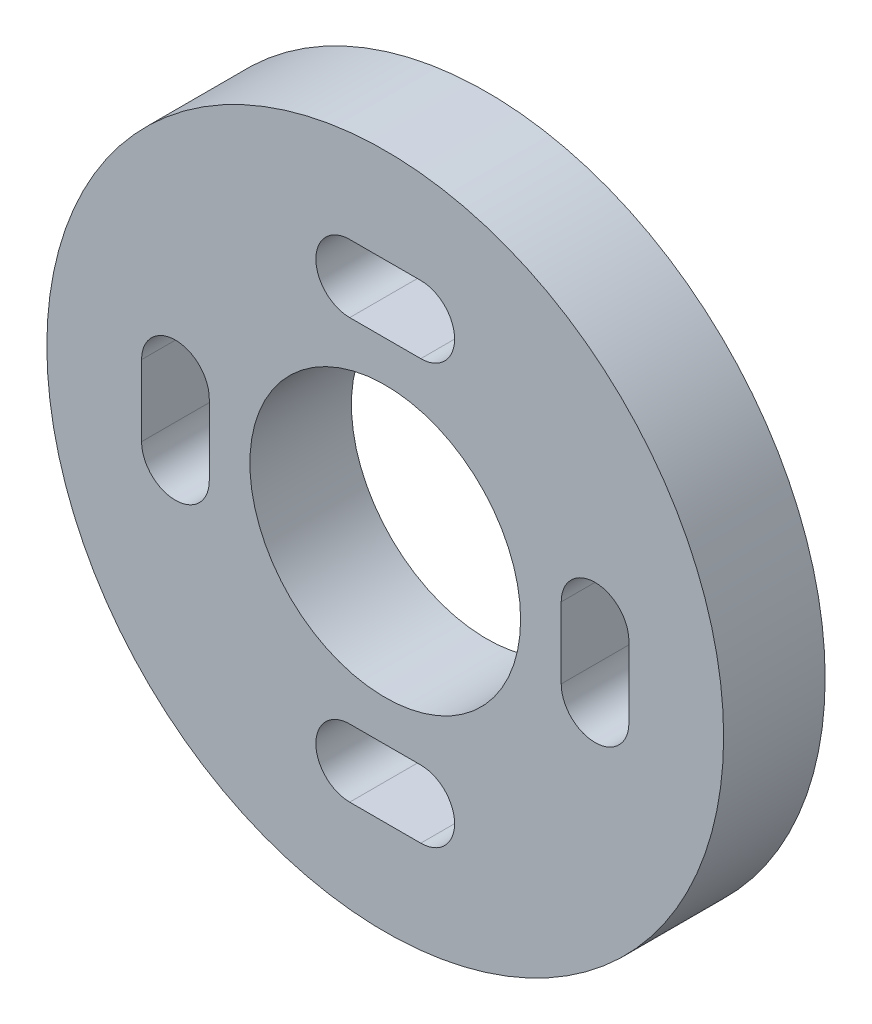
ISO-10303-21;
HEADER;
FILE_DESCRIPTION(('STEP AP214'),'2;1');
FILE_NAME('part.step','',(''),(''),'','','');
FILE_SCHEMA(('AUTOMOTIVE_DESIGN { 1 0 10303 214 1 1 1 1 }'));
ENDSEC;
DATA;
#1=APPLICATION_CONTEXT('core data for automotive mechanical design processes');
#2=APPLICATION_PROTOCOL_DEFINITION('international standard','automotive_design',2000,#1);
#3=PRODUCT_CONTEXT('',#1,'mechanical');
#4=PRODUCT('Part','Part','',(#3));
#5=PRODUCT_RELATED_PRODUCT_CATEGORY('part','',(#4));
#6=PRODUCT_DEFINITION_FORMATION('','',#4);
#7=PRODUCT_DEFINITION_CONTEXT('part definition',#1,'design');
#8=PRODUCT_DEFINITION('design','',#6,#7);
#9=PRODUCT_DEFINITION_SHAPE('','',#8);
#10=(LENGTH_UNIT() NAMED_UNIT(*) SI_UNIT(.MILLI.,.METRE.));
#11=(NAMED_UNIT(*) PLANE_ANGLE_UNIT() SI_UNIT($,.RADIAN.));
#12=(NAMED_UNIT(*) SI_UNIT($,.STERADIAN.) SOLID_ANGLE_UNIT());
#13=UNCERTAINTY_MEASURE_WITH_UNIT(LENGTH_MEASURE(1.E-05),#10,'distance_accuracy_value','');
#14=(GEOMETRIC_REPRESENTATION_CONTEXT(3) GLOBAL_UNCERTAINTY_ASSIGNED_CONTEXT((#13)) GLOBAL_UNIT_ASSIGNED_CONTEXT((#10,
#11,#12)) REPRESENTATION_CONTEXT('',''));
#15=CARTESIAN_POINT('',(0.,0.,0.));
#16=DIRECTION('',(0.,0.,1.));
#17=DIRECTION('',(1.,0.,0.));
#18=AXIS2_PLACEMENT_3D('',#15,#16,#17);
#19=CARTESIAN_POINT('',(0.,0.,3.));
#20=DIRECTION('',(0.,0.,-1.));
#21=DIRECTION('',(-1.,0.,0.));
#22=AXIS2_PLACEMENT_3D('',#19,#20,#21);
#23=CYLINDRICAL_SURFACE('',#22,10.);
#24=CARTESIAN_POINT('',(0.,0.,3.));
#25=DIRECTION('',(0.,0.,1.));
#26=DIRECTION('',(1.,0.,0.));
#27=AXIS2_PLACEMENT_3D('',#24,#25,#26);
#28=CIRCLE('',#27,10.);
#29=CARTESIAN_POINT('',(10.,0.,3.));
#30=VERTEX_POINT('',#29);
#31=EDGE_CURVE('E11',#30,#30,#28,.T.);
#32=ORIENTED_EDGE('',*,*,#31,.F.);
#33=EDGE_LOOP('',(#32));
#34=FACE_BOUND('',#33,.T.);
#35=CARTESIAN_POINT('',(0.,0.,0.));
#36=DIRECTION('',(0.,0.,1.));
#37=DIRECTION('',(1.,0.,0.));
#38=AXIS2_PLACEMENT_3D('',#35,#36,#37);
#39=CIRCLE('',#38,10.);
#40=CARTESIAN_POINT('',(10.,0.,0.));
#41=VERTEX_POINT('',#40);
#42=EDGE_CURVE('E39',#41,#41,#39,.T.);
#43=ORIENTED_EDGE('',*,*,#42,.T.);
#44=EDGE_LOOP('',(#43));
#45=FACE_BOUND('',#44,.T.);
#46=ADVANCED_FACE('F36',(#34,#45),#23,.T.);
#47=CARTESIAN_POINT('',(0.,0.,3.));
#48=DIRECTION('',(0.,0.,1.));
#49=DIRECTION('',(1.,0.,0.));
#50=AXIS2_PLACEMENT_3D('',#47,#48,#49);
#51=PLANE('',#50);
#52=DIRECTION('',(-1.,0.,0.));
#53=VECTOR('',#52,1.);
#54=CARTESIAN_POINT('',(0.,5.2,3.));
#55=LINE('',#54,#53);
#56=CARTESIAN_POINT('',(1.05,5.2,3.));
#57=VERTEX_POINT('',#56);
#58=CARTESIAN_POINT('',(-1.05,5.2,3.));
#59=VERTEX_POINT('',#58);
#60=EDGE_CURVE('E289',#57,#59,#55,.T.);
#61=ORIENTED_EDGE('',*,*,#60,.T.);
#62=CARTESIAN_POINT('',(-1.05,6.2,3.));
#63=DIRECTION('',(0.,0.,1.));
#64=DIRECTION('',(1.,0.,0.));
#65=AXIS2_PLACEMENT_3D('',#62,#63,#64);
#66=CIRCLE('',#65,1.);
#67=CARTESIAN_POINT('',(-1.05,7.2,3.));
#68=VERTEX_POINT('',#67);
#69=EDGE_CURVE('E292',#59,#68,#66,.F.);
#70=ORIENTED_EDGE('',*,*,#69,.T.);
#71=DIRECTION('',(1.,0.,0.));
#72=VECTOR('',#71,1.);
#73=CARTESIAN_POINT('',(0.,7.2,3.));
#74=LINE('',#73,#72);
#75=CARTESIAN_POINT('',(1.05,7.2,3.));
#76=VERTEX_POINT('',#75);
#77=EDGE_CURVE('E283',#68,#76,#74,.T.);
#78=ORIENTED_EDGE('',*,*,#77,.T.);
#79=CARTESIAN_POINT('',(1.05,6.2,3.));
#80=DIRECTION('',(0.,0.,1.));
#81=DIRECTION('',(1.,0.,0.));
#82=AXIS2_PLACEMENT_3D('',#79,#80,#81);
#83=CIRCLE('',#82,1.);
#84=EDGE_CURVE('E286',#76,#57,#83,.F.);
#85=ORIENTED_EDGE('',*,*,#84,.T.);
#86=EDGE_LOOP('',(#61,#70,#78,#85));
#87=FACE_BOUND('',#86,.T.);
#88=DIRECTION('',(0.,1.,0.));
#89=VECTOR('',#88,1.);
#90=CARTESIAN_POINT('',(-7.2,0.,3.));
#91=LINE('',#90,#89);
#92=CARTESIAN_POINT('',(-7.2,-1.05,3.));
#93=VERTEX_POINT('',#92);
#94=CARTESIAN_POINT('',(-7.2,1.05,3.));
#95=VERTEX_POINT('',#94);
#96=EDGE_CURVE('E277',#93,#95,#91,.T.);
#97=ORIENTED_EDGE('',*,*,#96,.T.);
#98=CARTESIAN_POINT('',(-6.2,1.05,3.));
#99=DIRECTION('',(0.,0.,1.));
#100=DIRECTION('',(1.,0.,0.));
#101=AXIS2_PLACEMENT_3D('',#98,#99,#100);
#102=CIRCLE('',#101,1.);
#103=CARTESIAN_POINT('',(-5.2,1.05,3.));
#104=VERTEX_POINT('',#103);
#105=EDGE_CURVE('E280',#95,#104,#102,.F.);
#106=ORIENTED_EDGE('',*,*,#105,.T.);
#107=DIRECTION('',(0.,-1.,0.));
#108=VECTOR('',#107,1.);
#109=CARTESIAN_POINT('',(-5.2,0.,3.));
#110=LINE('',#109,#108);
#111=CARTESIAN_POINT('',(-5.2,-1.05,3.));
#112=VERTEX_POINT('',#111);
#113=EDGE_CURVE('E271',#104,#112,#110,.T.);
#114=ORIENTED_EDGE('',*,*,#113,.T.);
#115=CARTESIAN_POINT('',(-6.2,-1.05,3.));
#116=DIRECTION('',(0.,0.,1.));
#117=DIRECTION('',(1.,0.,0.));
#118=AXIS2_PLACEMENT_3D('',#115,#116,#117);
#119=CIRCLE('',#118,1.);
#120=EDGE_CURVE('E274',#112,#93,#119,.F.);
#121=ORIENTED_EDGE('',*,*,#120,.T.);
#122=EDGE_LOOP('',(#97,#106,#114,#121));
#123=FACE_BOUND('',#122,.T.);
#124=DIRECTION('',(0.,1.,0.));
#125=VECTOR('',#124,1.);
#126=CARTESIAN_POINT('',(5.2,0.,3.));
#127=LINE('',#126,#125);
#128=CARTESIAN_POINT('',(5.2,-1.05,3.));
#129=VERTEX_POINT('',#128);
#130=CARTESIAN_POINT('',(5.2,1.05,3.));
#131=VERTEX_POINT('',#130);
#132=EDGE_CURVE('E268',#129,#131,#127,.T.);
#133=ORIENTED_EDGE('',*,*,#132,.T.);
#134=CARTESIAN_POINT('',(6.2,1.05,3.));
#135=DIRECTION('',(0.,0.,1.));
#136=DIRECTION('',(1.,0.,0.));
#137=AXIS2_PLACEMENT_3D('',#134,#135,#136);
#138=CIRCLE('',#137,1.);
#139=CARTESIAN_POINT('',(7.2,1.05,3.));
#140=VERTEX_POINT('',#139);
#141=EDGE_CURVE('E155',#131,#140,#138,.F.);
#142=ORIENTED_EDGE('',*,*,#141,.T.);
#143=DIRECTION('',(0.,-1.,0.));
#144=VECTOR('',#143,1.);
#145=CARTESIAN_POINT('',(7.2,0.,3.));
#146=LINE('',#145,#144);
#147=CARTESIAN_POINT('',(7.2,-1.05,3.));
#148=VERTEX_POINT('',#147);
#149=EDGE_CURVE('E262',#140,#148,#146,.T.);
#150=ORIENTED_EDGE('',*,*,#149,.T.);
#151=CARTESIAN_POINT('',(6.2,-1.05,3.));
#152=DIRECTION('',(0.,0.,1.));
#153=DIRECTION('',(1.,0.,0.));
#154=AXIS2_PLACEMENT_3D('',#151,#152,#153);
#155=CIRCLE('',#154,1.);
#156=EDGE_CURVE('E265',#148,#129,#155,.F.);
#157=ORIENTED_EDGE('',*,*,#156,.T.);
#158=EDGE_LOOP('',(#133,#142,#150,#157));
#159=FACE_BOUND('',#158,.T.);
#160=DIRECTION('',(-1.,0.,0.));
#161=VECTOR('',#160,1.);
#162=CARTESIAN_POINT('',(0.,-7.2,3.));
#163=LINE('',#162,#161);
#164=CARTESIAN_POINT('',(1.05,-7.2,3.));
#165=VERTEX_POINT('',#164);
#166=CARTESIAN_POINT('',(-1.05,-7.2,3.));
#167=VERTEX_POINT('',#166);
#168=EDGE_CURVE('E256',#165,#167,#163,.T.);
#169=ORIENTED_EDGE('',*,*,#168,.T.);
#170=CARTESIAN_POINT('',(-1.05,-6.2,3.));
#171=DIRECTION('',(0.,0.,1.));
#172=DIRECTION('',(1.,0.,0.));
#173=AXIS2_PLACEMENT_3D('',#170,#171,#172);
#174=CIRCLE('',#173,1.);
#175=CARTESIAN_POINT('',(-1.05,-5.2,3.));
#176=VERTEX_POINT('',#175);
#177=EDGE_CURVE('E259',#167,#176,#174,.F.);
#178=ORIENTED_EDGE('',*,*,#177,.T.);
#179=DIRECTION('',(1.,0.,0.));
#180=VECTOR('',#179,1.);
#181=CARTESIAN_POINT('',(0.,-5.2,3.));
#182=LINE('',#181,#180);
#183=CARTESIAN_POINT('',(1.05,-5.2,3.));
#184=VERTEX_POINT('',#183);
#185=EDGE_CURVE('E250',#176,#184,#182,.T.);
#186=ORIENTED_EDGE('',*,*,#185,.T.);
#187=CARTESIAN_POINT('',(1.05,-6.2,3.));
#188=DIRECTION('',(0.,0.,1.));
#189=DIRECTION('',(1.,0.,0.));
#190=AXIS2_PLACEMENT_3D('',#187,#188,#189);
#191=CIRCLE('',#190,1.);
#192=EDGE_CURVE('E253',#184,#165,#191,.F.);
#193=ORIENTED_EDGE('',*,*,#192,.T.);
#194=EDGE_LOOP('',(#169,#178,#186,#193));
#195=FACE_BOUND('',#194,.T.);
#196=CARTESIAN_POINT('',(0.,0.,3.));
#197=DIRECTION('',(0.,0.,1.));
#198=DIRECTION('',(1.,0.,0.));
#199=AXIS2_PLACEMENT_3D('',#196,#197,#198);
#200=CIRCLE('',#199,4.);
#201=CARTESIAN_POINT('',(4.,0.,3.));
#202=VERTEX_POINT('',#201);
#203=EDGE_CURVE('E247',#202,#202,#200,.F.);
#204=ORIENTED_EDGE('',*,*,#203,.T.);
#205=EDGE_LOOP('',(#204));
#206=FACE_BOUND('',#205,.T.);
#207=ORIENTED_EDGE('',*,*,#31,.T.);
#208=EDGE_LOOP('',(#207));
#209=FACE_BOUND('',#208,.T.);
#210=ADVANCED_FACE('F301',(#87,#123,#159,#195,#206,#209),#51,.T.);
#211=CARTESIAN_POINT('',(0.,0.,0.));
#212=DIRECTION('',(0.,0.,1.));
#213=DIRECTION('',(1.,0.,0.));
#214=AXIS2_PLACEMENT_3D('',#211,#212,#213);
#215=PLANE('',#214);
#216=CARTESIAN_POINT('',(-1.05,6.2,0.));
#217=DIRECTION('',(0.,0.,1.));
#218=DIRECTION('',(1.,0.,0.));
#219=AXIS2_PLACEMENT_3D('',#216,#217,#218);
#220=CIRCLE('',#219,1.);
#221=CARTESIAN_POINT('',(-1.05,7.2,0.));
#222=VERTEX_POINT('',#221);
#223=CARTESIAN_POINT('',(-1.05,5.2,0.));
#224=VERTEX_POINT('',#223);
#225=EDGE_CURVE('E205',#222,#224,#220,.T.);
#226=ORIENTED_EDGE('',*,*,#225,.T.);
#227=DIRECTION('',(1.,0.,0.));
#228=VECTOR('',#227,1.);
#229=CARTESIAN_POINT('',(-1.05,5.2,0.));
#230=LINE('',#229,#228);
#231=CARTESIAN_POINT('',(1.05,5.2,0.));
#232=VERTEX_POINT('',#231);
#233=EDGE_CURVE('E208',#224,#232,#230,.T.);
#234=ORIENTED_EDGE('',*,*,#233,.T.);
#235=CARTESIAN_POINT('',(1.05,6.2,0.));
#236=DIRECTION('',(0.,0.,1.));
#237=DIRECTION('',(1.,0.,0.));
#238=AXIS2_PLACEMENT_3D('',#235,#236,#237);
#239=CIRCLE('',#238,1.);
#240=CARTESIAN_POINT('',(1.05,7.2,0.));
#241=VERTEX_POINT('',#240);
#242=EDGE_CURVE('E212',#232,#241,#239,.T.);
#243=ORIENTED_EDGE('',*,*,#242,.T.);
#244=DIRECTION('',(-1.,0.,0.));
#245=VECTOR('',#244,1.);
#246=CARTESIAN_POINT('',(-1.05,7.2,0.));
#247=LINE('',#246,#245);
#248=EDGE_CURVE('E215',#241,#222,#247,.T.);
#249=ORIENTED_EDGE('',*,*,#248,.T.);
#250=EDGE_LOOP('',(#226,#234,#243,#249));
#251=FACE_BOUND('',#250,.T.);
#252=CARTESIAN_POINT('',(-6.2,1.05,0.));
#253=DIRECTION('',(0.,0.,1.));
#254=DIRECTION('',(1.,0.,0.));
#255=AXIS2_PLACEMENT_3D('',#252,#253,#254);
#256=CIRCLE('',#255,1.);
#257=CARTESIAN_POINT('',(-5.2,1.05,0.));
#258=VERTEX_POINT('',#257);
#259=CARTESIAN_POINT('',(-7.2,1.05,0.));
#260=VERTEX_POINT('',#259);
#261=EDGE_CURVE('E158',#258,#260,#256,.T.);
#262=ORIENTED_EDGE('',*,*,#261,.T.);
#263=DIRECTION('',(0.,-1.,0.));
#264=VECTOR('',#263,1.);
#265=CARTESIAN_POINT('',(-7.2,1.05,0.));
#266=LINE('',#265,#264);
#267=CARTESIAN_POINT('',(-7.2,-1.05,0.));
#268=VERTEX_POINT('',#267);
#269=EDGE_CURVE('E229',#260,#268,#266,.T.);
#270=ORIENTED_EDGE('',*,*,#269,.T.);
#271=CARTESIAN_POINT('',(-6.2,-1.05,0.));
#272=DIRECTION('',(0.,0.,1.));
#273=DIRECTION('',(1.,0.,0.));
#274=AXIS2_PLACEMENT_3D('',#271,#272,#273);
#275=CIRCLE('',#274,1.);
#276=CARTESIAN_POINT('',(-5.2,-1.05,0.));
#277=VERTEX_POINT('',#276);
#278=EDGE_CURVE('E232',#268,#277,#275,.T.);
#279=ORIENTED_EDGE('',*,*,#278,.T.);
#280=DIRECTION('',(0.,1.,0.));
#281=VECTOR('',#280,1.);
#282=CARTESIAN_POINT('',(-5.2,1.05,0.));
#283=LINE('',#282,#281);
#284=EDGE_CURVE('E235',#277,#258,#283,.T.);
#285=ORIENTED_EDGE('',*,*,#284,.T.);
#286=EDGE_LOOP('',(#262,#270,#279,#285));
#287=FACE_BOUND('',#286,.T.);
#288=CARTESIAN_POINT('',(6.2,1.05,0.));
#289=DIRECTION('',(0.,0.,1.));
#290=DIRECTION('',(-1.,0.,0.));
#291=AXIS2_PLACEMENT_3D('',#288,#289,#290);
#292=CIRCLE('',#291,1.);
#293=CARTESIAN_POINT('',(7.2,1.05,0.));
#294=VERTEX_POINT('',#293);
#295=CARTESIAN_POINT('',(5.2,1.05,0.));
#296=VERTEX_POINT('',#295);
#297=EDGE_CURVE('E152',#294,#296,#292,.T.);
#298=ORIENTED_EDGE('',*,*,#297,.T.);
#299=DIRECTION('',(0.,-1.,0.));
#300=VECTOR('',#299,1.);
#301=CARTESIAN_POINT('',(5.2,1.05,0.));
#302=LINE('',#301,#300);
#303=CARTESIAN_POINT('',(5.2,-1.05,0.));
#304=VERTEX_POINT('',#303);
#305=EDGE_CURVE('E162',#296,#304,#302,.T.);
#306=ORIENTED_EDGE('',*,*,#305,.T.);
#307=CARTESIAN_POINT('',(6.2,-1.05,0.));
#308=DIRECTION('',(0.,0.,1.));
#309=DIRECTION('',(-1.,0.,0.));
#310=AXIS2_PLACEMENT_3D('',#307,#308,#309);
#311=CIRCLE('',#310,1.);
#312=CARTESIAN_POINT('',(7.2,-1.05,0.));
#313=VERTEX_POINT('',#312);
#314=EDGE_CURVE('E168',#304,#313,#311,.T.);
#315=ORIENTED_EDGE('',*,*,#314,.T.);
#316=DIRECTION('',(0.,1.,0.));
#317=VECTOR('',#316,1.);
#318=CARTESIAN_POINT('',(7.2,1.05,0.));
#319=LINE('',#318,#317);
#320=EDGE_CURVE('E174',#313,#294,#319,.T.);
#321=ORIENTED_EDGE('',*,*,#320,.T.);
#322=EDGE_LOOP('',(#298,#306,#315,#321));
#323=FACE_BOUND('',#322,.T.);
#324=CARTESIAN_POINT('',(-1.05,-6.2,0.));
#325=DIRECTION('',(0.,0.,1.));
#326=DIRECTION('',(-1.,0.,0.));
#327=AXIS2_PLACEMENT_3D('',#324,#325,#326);
#328=CIRCLE('',#327,1.);
#329=CARTESIAN_POINT('',(-1.05,-5.2,0.));
#330=VERTEX_POINT('',#329);
#331=CARTESIAN_POINT('',(-1.05,-7.2,0.));
#332=VERTEX_POINT('',#331);
#333=EDGE_CURVE('E187',#330,#332,#328,.T.);
#334=ORIENTED_EDGE('',*,*,#333,.T.);
#335=DIRECTION('',(1.,0.,0.));
#336=VECTOR('',#335,1.);
#337=CARTESIAN_POINT('',(-1.05,-7.2,0.));
#338=LINE('',#337,#336);
#339=CARTESIAN_POINT('',(1.05,-7.2,0.));
#340=VERTEX_POINT('',#339);
#341=EDGE_CURVE('E190',#332,#340,#338,.T.);
#342=ORIENTED_EDGE('',*,*,#341,.T.);
#343=CARTESIAN_POINT('',(1.05,-6.2,0.));
#344=DIRECTION('',(0.,0.,1.));
#345=DIRECTION('',(-1.,0.,0.));
#346=AXIS2_PLACEMENT_3D('',#343,#344,#345);
#347=CIRCLE('',#346,1.);
#348=CARTESIAN_POINT('',(1.05,-5.2,0.));
#349=VERTEX_POINT('',#348);
#350=EDGE_CURVE('E193',#340,#349,#347,.T.);
#351=ORIENTED_EDGE('',*,*,#350,.T.);
#352=DIRECTION('',(-1.,0.,0.));
#353=VECTOR('',#352,1.);
#354=CARTESIAN_POINT('',(-1.05,-5.2,0.));
#355=LINE('',#354,#353);
#356=EDGE_CURVE('E196',#349,#330,#355,.T.);
#357=ORIENTED_EDGE('',*,*,#356,.T.);
#358=EDGE_LOOP('',(#334,#342,#351,#357));
#359=FACE_BOUND('',#358,.T.);
#360=CARTESIAN_POINT('',(0.,0.,0.));
#361=DIRECTION('',(0.,0.,1.));
#362=DIRECTION('',(1.,0.,0.));
#363=AXIS2_PLACEMENT_3D('',#360,#361,#362);
#364=CIRCLE('',#363,4.);
#365=CARTESIAN_POINT('',(4.,0.,0.));
#366=VERTEX_POINT('',#365);
#367=EDGE_CURVE('E226',#366,#366,#364,.T.);
#368=ORIENTED_EDGE('',*,*,#367,.T.);
#369=EDGE_LOOP('',(#368));
#370=FACE_BOUND('',#369,.T.);
#371=ORIENTED_EDGE('',*,*,#42,.F.);
#372=EDGE_LOOP('',(#371));
#373=FACE_BOUND('',#372,.T.);
#374=ADVANCED_FACE('F171',(#251,#287,#323,#359,#370,#373),#215,.F.);
#375=CARTESIAN_POINT('',(0.,0.,4.));
#376=DIRECTION('',(0.,0.,-1.));
#377=DIRECTION('',(-1.,0.,0.));
#378=AXIS2_PLACEMENT_3D('',#375,#376,#377);
#379=CYLINDRICAL_SURFACE('',#378,4.);
#380=ORIENTED_EDGE('',*,*,#203,.F.);
#381=EDGE_LOOP('',(#380));
#382=FACE_BOUND('',#381,.T.);
#383=ORIENTED_EDGE('',*,*,#367,.F.);
#384=EDGE_LOOP('',(#383));
#385=FACE_BOUND('',#384,.T.);
#386=ADVANCED_FACE('F300',(#382,#385),#379,.F.);
#387=CARTESIAN_POINT('',(-1.05,-6.2,4.));
#388=DIRECTION('',(0.,0.,-1.));
#389=DIRECTION('',(-1.,0.,0.));
#390=AXIS2_PLACEMENT_3D('',#387,#388,#389);
#391=CYLINDRICAL_SURFACE('',#390,1.);
#392=DIRECTION('',(0.,0.,-1.));
#393=VECTOR('',#392,1.);
#394=CARTESIAN_POINT('',(-1.05,-7.2,4.));
#395=LINE('',#394,#393);
#396=EDGE_CURVE('E175',#167,#332,#395,.T.);
#397=ORIENTED_EDGE('',*,*,#396,.T.);
#398=ORIENTED_EDGE('',*,*,#333,.F.);
#399=DIRECTION('',(0.,0.,-1.));
#400=VECTOR('',#399,1.);
#401=CARTESIAN_POINT('',(-1.05,-5.2,4.));
#402=LINE('',#401,#400);
#403=EDGE_CURVE('E199',#176,#330,#402,.T.);
#404=ORIENTED_EDGE('',*,*,#403,.F.);
#405=ORIENTED_EDGE('',*,*,#177,.F.);
#406=EDGE_LOOP('',(#397,#398,#404,#405));
#407=FACE_BOUND('',#406,.T.);
#408=ADVANCED_FACE('F307',(#407),#391,.F.);
#409=CARTESIAN_POINT('',(-1.05,-7.2,4.));
#410=DIRECTION('',(0.,1.,0.));
#411=DIRECTION('',(0.,0.,1.));
#412=AXIS2_PLACEMENT_3D('',#409,#410,#411);
#413=PLANE('',#412);
#414=DIRECTION('',(0.,0.,-1.));
#415=VECTOR('',#414,1.);
#416=CARTESIAN_POINT('',(1.05,-7.2,4.));
#417=LINE('',#416,#415);
#418=EDGE_CURVE('E177',#165,#340,#417,.T.);
#419=ORIENTED_EDGE('',*,*,#418,.T.);
#420=ORIENTED_EDGE('',*,*,#341,.F.);
#421=ORIENTED_EDGE('',*,*,#396,.F.);
#422=ORIENTED_EDGE('',*,*,#168,.F.);
#423=EDGE_LOOP('',(#419,#420,#421,#422));
#424=FACE_BOUND('',#423,.T.);
#425=ADVANCED_FACE('F341',(#424),#413,.T.);
#426=CARTESIAN_POINT('',(1.05,-6.2,4.));
#427=DIRECTION('',(0.,0.,-1.));
#428=DIRECTION('',(-1.,0.,0.));
#429=AXIS2_PLACEMENT_3D('',#426,#427,#428);
#430=CYLINDRICAL_SURFACE('',#429,1.);
#431=DIRECTION('',(0.,0.,-1.));
#432=VECTOR('',#431,1.);
#433=CARTESIAN_POINT('',(1.05,-5.2,4.));
#434=LINE('',#433,#432);
#435=EDGE_CURVE('E202',#184,#349,#434,.T.);
#436=ORIENTED_EDGE('',*,*,#435,.T.);
#437=ORIENTED_EDGE('',*,*,#350,.F.);
#438=ORIENTED_EDGE('',*,*,#418,.F.);
#439=ORIENTED_EDGE('',*,*,#192,.F.);
#440=EDGE_LOOP('',(#436,#437,#438,#439));
#441=FACE_BOUND('',#440,.T.);
#442=ADVANCED_FACE('F351',(#441),#430,.F.);
#443=CARTESIAN_POINT('',(-1.05,-5.2,4.));
#444=DIRECTION('',(0.,-1.,0.));
#445=DIRECTION('',(0.,0.,-1.));
#446=AXIS2_PLACEMENT_3D('',#443,#444,#445);
#447=PLANE('',#446);
#448=ORIENTED_EDGE('',*,*,#403,.T.);
#449=ORIENTED_EDGE('',*,*,#356,.F.);
#450=ORIENTED_EDGE('',*,*,#435,.F.);
#451=ORIENTED_EDGE('',*,*,#185,.F.);
#452=EDGE_LOOP('',(#448,#449,#450,#451));
#453=FACE_BOUND('',#452,.T.);
#454=ADVANCED_FACE('F361',(#453),#447,.T.);
#455=CARTESIAN_POINT('',(6.2,1.05,4.));
#456=DIRECTION('',(0.,0.,-1.));
#457=DIRECTION('',(-1.,0.,0.));
#458=AXIS2_PLACEMENT_3D('',#455,#456,#457);
#459=CYLINDRICAL_SURFACE('',#458,1.);
#460=DIRECTION('',(0.,0.,-1.));
#461=VECTOR('',#460,1.);
#462=CARTESIAN_POINT('',(5.2,1.05,4.));
#463=LINE('',#462,#461);
#464=EDGE_CURVE('E147',#131,#296,#463,.T.);
#465=ORIENTED_EDGE('',*,*,#464,.T.);
#466=ORIENTED_EDGE('',*,*,#297,.F.);
#467=DIRECTION('',(0.,0.,-1.));
#468=VECTOR('',#467,1.);
#469=CARTESIAN_POINT('',(7.2,1.05,4.));
#470=LINE('',#469,#468);
#471=EDGE_CURVE('E182',#140,#294,#470,.T.);
#472=ORIENTED_EDGE('',*,*,#471,.F.);
#473=ORIENTED_EDGE('',*,*,#141,.F.);
#474=EDGE_LOOP('',(#465,#466,#472,#473));
#475=FACE_BOUND('',#474,.T.);
#476=ADVANCED_FACE('F149',(#475),#459,.F.);
#477=CARTESIAN_POINT('',(5.2,1.05,4.));
#478=DIRECTION('',(1.,0.,0.));
#479=DIRECTION('',(0.,1.,0.));
#480=AXIS2_PLACEMENT_3D('',#477,#478,#479);
#481=PLANE('',#480);
#482=DIRECTION('',(0.,0.,-1.));
#483=VECTOR('',#482,1.);
#484=CARTESIAN_POINT('',(5.2,-1.05,4.));
#485=LINE('',#484,#483);
#486=EDGE_CURVE('E159',#129,#304,#485,.T.);
#487=ORIENTED_EDGE('',*,*,#486,.T.);
#488=ORIENTED_EDGE('',*,*,#305,.F.);
#489=ORIENTED_EDGE('',*,*,#464,.F.);
#490=ORIENTED_EDGE('',*,*,#132,.F.);
#491=EDGE_LOOP('',(#487,#488,#489,#490));
#492=FACE_BOUND('',#491,.T.);
#493=ADVANCED_FACE('F163',(#492),#481,.T.);
#494=CARTESIAN_POINT('',(6.2,-1.05,4.));
#495=DIRECTION('',(0.,0.,-1.));
#496=DIRECTION('',(-1.,0.,0.));
#497=AXIS2_PLACEMENT_3D('',#494,#495,#496);
#498=CYLINDRICAL_SURFACE('',#497,1.);
#499=DIRECTION('',(0.,0.,-1.));
#500=VECTOR('',#499,1.);
#501=CARTESIAN_POINT('',(7.2,-1.05,4.));
#502=LINE('',#501,#500);
#503=EDGE_CURVE('E184',#148,#313,#502,.T.);
#504=ORIENTED_EDGE('',*,*,#503,.T.);
#505=ORIENTED_EDGE('',*,*,#314,.F.);
#506=ORIENTED_EDGE('',*,*,#486,.F.);
#507=ORIENTED_EDGE('',*,*,#156,.F.);
#508=EDGE_LOOP('',(#504,#505,#506,#507));
#509=FACE_BOUND('',#508,.T.);
#510=ADVANCED_FACE('F388',(#509),#498,.F.);
#511=CARTESIAN_POINT('',(7.2,1.05,4.));
#512=DIRECTION('',(-1.,0.,0.));
#513=DIRECTION('',(0.,-1.,0.));
#514=AXIS2_PLACEMENT_3D('',#511,#512,#513);
#515=PLANE('',#514);
#516=ORIENTED_EDGE('',*,*,#471,.T.);
#517=ORIENTED_EDGE('',*,*,#320,.F.);
#518=ORIENTED_EDGE('',*,*,#503,.F.);
#519=ORIENTED_EDGE('',*,*,#149,.F.);
#520=EDGE_LOOP('',(#516,#517,#518,#519));
#521=FACE_BOUND('',#520,.T.);
#522=ADVANCED_FACE('F397',(#521),#515,.T.);
#523=CARTESIAN_POINT('',(-6.2,1.05,4.));
#524=DIRECTION('',(0.,0.,-1.));
#525=DIRECTION('',(-1.,0.,0.));
#526=AXIS2_PLACEMENT_3D('',#523,#524,#525);
#527=CYLINDRICAL_SURFACE('',#526,1.);
#528=DIRECTION('',(0.,0.,-1.));
#529=VECTOR('',#528,1.);
#530=CARTESIAN_POINT('',(-7.2,1.05,4.));
#531=LINE('',#530,#529);
#532=EDGE_CURVE('E209',#95,#260,#531,.T.);
#533=ORIENTED_EDGE('',*,*,#532,.T.);
#534=ORIENTED_EDGE('',*,*,#261,.F.);
#535=DIRECTION('',(0.,0.,-1.));
#536=VECTOR('',#535,1.);
#537=CARTESIAN_POINT('',(-5.2,1.05,4.));
#538=LINE('',#537,#536);
#539=EDGE_CURVE('E238',#104,#258,#538,.T.);
#540=ORIENTED_EDGE('',*,*,#539,.F.);
#541=ORIENTED_EDGE('',*,*,#105,.F.);
#542=EDGE_LOOP('',(#533,#534,#540,#541));
#543=FACE_BOUND('',#542,.T.);
#544=ADVANCED_FACE('F407',(#543),#527,.F.);
#545=CARTESIAN_POINT('',(-7.2,1.05,4.));
#546=DIRECTION('',(1.,0.,0.));
#547=DIRECTION('',(0.,1.,0.));
#548=AXIS2_PLACEMENT_3D('',#545,#546,#547);
#549=PLANE('',#548);
#550=DIRECTION('',(0.,0.,-1.));
#551=VECTOR('',#550,1.);
#552=CARTESIAN_POINT('',(-7.2,-1.05,4.));
#553=LINE('',#552,#551);
#554=EDGE_CURVE('E242',#93,#268,#553,.T.);
#555=ORIENTED_EDGE('',*,*,#554,.T.);
#556=ORIENTED_EDGE('',*,*,#269,.F.);
#557=ORIENTED_EDGE('',*,*,#532,.F.);
#558=ORIENTED_EDGE('',*,*,#96,.F.);
#559=EDGE_LOOP('',(#555,#556,#557,#558));
#560=FACE_BOUND('',#559,.T.);
#561=ADVANCED_FACE('F417',(#560),#549,.T.);
#562=CARTESIAN_POINT('',(-6.2,-1.05,4.));
#563=DIRECTION('',(0.,0.,-1.));
#564=DIRECTION('',(-1.,0.,0.));
#565=AXIS2_PLACEMENT_3D('',#562,#563,#564);
#566=CYLINDRICAL_SURFACE('',#565,1.);
#567=DIRECTION('',(0.,0.,-1.));
#568=VECTOR('',#567,1.);
#569=CARTESIAN_POINT('',(-5.2,-1.05,4.));
#570=LINE('',#569,#568);
#571=EDGE_CURVE('E58',#112,#277,#570,.T.);
#572=ORIENTED_EDGE('',*,*,#571,.T.);
#573=ORIENTED_EDGE('',*,*,#278,.F.);
#574=ORIENTED_EDGE('',*,*,#554,.F.);
#575=ORIENTED_EDGE('',*,*,#120,.F.);
#576=EDGE_LOOP('',(#572,#573,#574,#575));
#577=FACE_BOUND('',#576,.T.);
#578=ADVANCED_FACE('F427',(#577),#566,.F.);
#579=CARTESIAN_POINT('',(-5.2,1.05,4.));
#580=DIRECTION('',(-1.,0.,0.));
#581=DIRECTION('',(0.,-1.,0.));
#582=AXIS2_PLACEMENT_3D('',#579,#580,#581);
#583=PLANE('',#582);
#584=ORIENTED_EDGE('',*,*,#539,.T.);
#585=ORIENTED_EDGE('',*,*,#284,.F.);
#586=ORIENTED_EDGE('',*,*,#571,.F.);
#587=ORIENTED_EDGE('',*,*,#113,.F.);
#588=EDGE_LOOP('',(#584,#585,#586,#587));
#589=FACE_BOUND('',#588,.T.);
#590=ADVANCED_FACE('F437',(#589),#583,.T.);
#591=CARTESIAN_POINT('',(-1.05,6.2,4.));
#592=DIRECTION('',(0.,0.,-1.));
#593=DIRECTION('',(-1.,0.,0.));
#594=AXIS2_PLACEMENT_3D('',#591,#592,#593);
#595=CYLINDRICAL_SURFACE('',#594,1.);
#596=DIRECTION('',(0.,0.,-1.));
#597=VECTOR('',#596,1.);
#598=CARTESIAN_POINT('',(-1.05,5.2,4.));
#599=LINE('',#598,#597);
#600=EDGE_CURVE('E224',#59,#224,#599,.T.);
#601=ORIENTED_EDGE('',*,*,#600,.T.);
#602=ORIENTED_EDGE('',*,*,#225,.F.);
#603=DIRECTION('',(0.,0.,-1.));
#604=VECTOR('',#603,1.);
#605=CARTESIAN_POINT('',(-1.05,7.2,4.));
#606=LINE('',#605,#604);
#607=EDGE_CURVE('E218',#68,#222,#606,.T.);
#608=ORIENTED_EDGE('',*,*,#607,.F.);
#609=ORIENTED_EDGE('',*,*,#69,.F.);
#610=EDGE_LOOP('',(#601,#602,#608,#609));
#611=FACE_BOUND('',#610,.T.);
#612=ADVANCED_FACE('F447',(#611),#595,.F.);
#613=CARTESIAN_POINT('',(-1.05,5.2,4.));
#614=DIRECTION('',(0.,1.,0.));
#615=DIRECTION('',(0.,0.,1.));
#616=AXIS2_PLACEMENT_3D('',#613,#614,#615);
#617=PLANE('',#616);
#618=DIRECTION('',(0.,0.,-1.));
#619=VECTOR('',#618,1.);
#620=CARTESIAN_POINT('',(1.05,5.2,4.));
#621=LINE('',#620,#619);
#622=EDGE_CURVE('E222',#57,#232,#621,.T.);
#623=ORIENTED_EDGE('',*,*,#622,.T.);
#624=ORIENTED_EDGE('',*,*,#233,.F.);
#625=ORIENTED_EDGE('',*,*,#600,.F.);
#626=ORIENTED_EDGE('',*,*,#60,.F.);
#627=EDGE_LOOP('',(#623,#624,#625,#626));
#628=FACE_BOUND('',#627,.T.);
#629=ADVANCED_FACE('F456',(#628),#617,.T.);
#630=CARTESIAN_POINT('',(1.05,6.2,4.));
#631=DIRECTION('',(0.,0.,-1.));
#632=DIRECTION('',(-1.,0.,0.));
#633=AXIS2_PLACEMENT_3D('',#630,#631,#632);
#634=CYLINDRICAL_SURFACE('',#633,1.);
#635=DIRECTION('',(0.,0.,-1.));
#636=VECTOR('',#635,1.);
#637=CARTESIAN_POINT('',(1.05,7.2,4.));
#638=LINE('',#637,#636);
#639=EDGE_CURVE('E50',#76,#241,#638,.T.);
#640=ORIENTED_EDGE('',*,*,#639,.T.);
#641=ORIENTED_EDGE('',*,*,#242,.F.);
#642=ORIENTED_EDGE('',*,*,#622,.F.);
#643=ORIENTED_EDGE('',*,*,#84,.F.);
#644=EDGE_LOOP('',(#640,#641,#642,#643));
#645=FACE_BOUND('',#644,.T.);
#646=ADVANCED_FACE('F466',(#645),#634,.F.);
#647=CARTESIAN_POINT('',(-1.05,7.2,4.));
#648=DIRECTION('',(0.,-1.,0.));
#649=DIRECTION('',(0.,0.,-1.));
#650=AXIS2_PLACEMENT_3D('',#647,#648,#649);
#651=PLANE('',#650);
#652=ORIENTED_EDGE('',*,*,#607,.T.);
#653=ORIENTED_EDGE('',*,*,#248,.F.);
#654=ORIENTED_EDGE('',*,*,#639,.F.);
#655=ORIENTED_EDGE('',*,*,#77,.F.);
#656=EDGE_LOOP('',(#652,#653,#654,#655));
#657=FACE_BOUND('',#656,.T.);
#658=ADVANCED_FACE('F476',(#657),#651,.T.);
#659=CLOSED_SHELL('',(#46,#210,#374,#386,#408,#425,#442,#454,#476,#493,#510,#522,#544,#561,#578,
#590,#612,#629,#646,#658));
#660=MANIFOLD_SOLID_BREP('B2',#659);
#661=ADVANCED_BREP_SHAPE_REPRESENTATION('',(#18,#660),#14);
#662=SHAPE_DEFINITION_REPRESENTATION(#9,#661);
ENDSEC;
END-ISO-10303-21;
